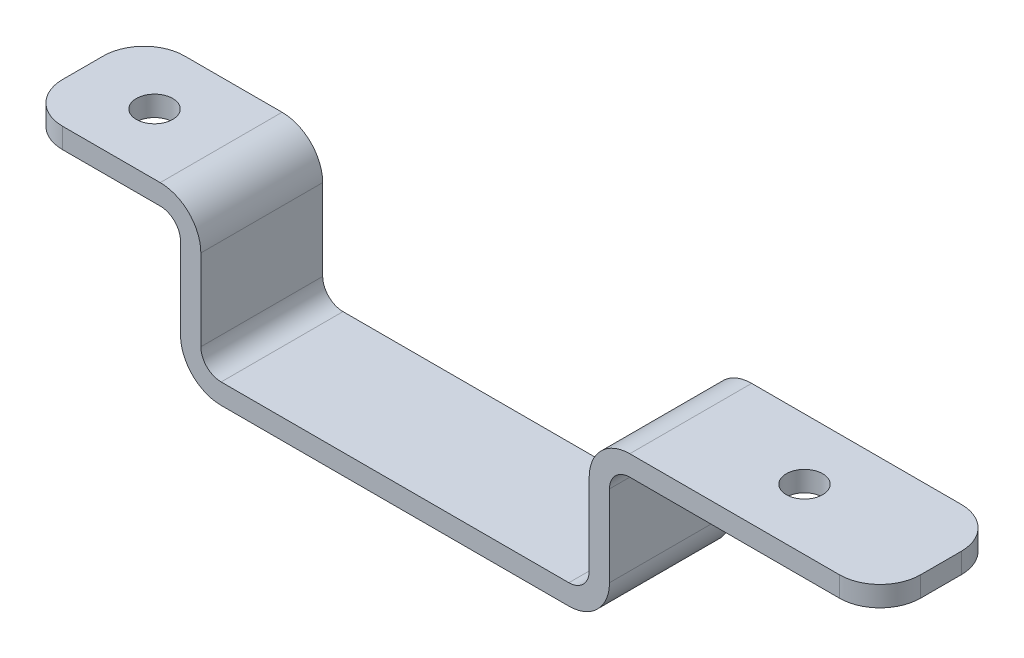
ISO-10303-21;
HEADER;
FILE_DESCRIPTION(('STEP AP214'),'2;1');
FILE_NAME('part.step','',(''),(''),'','','');
FILE_SCHEMA(('AUTOMOTIVE_DESIGN { 1 0 10303 214 1 1 1 1 }'));
ENDSEC;
DATA;
#1=APPLICATION_CONTEXT('core data for automotive mechanical design processes');
#2=APPLICATION_PROTOCOL_DEFINITION('international standard','automotive_design',2000,#1);
#3=PRODUCT_CONTEXT('',#1,'mechanical');
#4=PRODUCT('Part','Part','',(#3));
#5=PRODUCT_RELATED_PRODUCT_CATEGORY('part','',(#4));
#6=PRODUCT_DEFINITION_FORMATION('','',#4);
#7=PRODUCT_DEFINITION_CONTEXT('part definition',#1,'design');
#8=PRODUCT_DEFINITION('design','',#6,#7);
#9=PRODUCT_DEFINITION_SHAPE('','',#8);
#10=(LENGTH_UNIT() NAMED_UNIT(*) SI_UNIT(.MILLI.,.METRE.));
#11=(NAMED_UNIT(*) PLANE_ANGLE_UNIT() SI_UNIT($,.RADIAN.));
#12=(NAMED_UNIT(*) SI_UNIT($,.STERADIAN.) SOLID_ANGLE_UNIT());
#13=UNCERTAINTY_MEASURE_WITH_UNIT(LENGTH_MEASURE(1.E-05),#10,'distance_accuracy_value','');
#14=(GEOMETRIC_REPRESENTATION_CONTEXT(3) GLOBAL_UNCERTAINTY_ASSIGNED_CONTEXT((#13)) GLOBAL_UNIT_ASSIGNED_CONTEXT((#10,
#11,#12)) REPRESENTATION_CONTEXT('',''));
#15=CARTESIAN_POINT('',(0.,0.,0.));
#16=DIRECTION('',(0.,0.,1.));
#17=DIRECTION('',(1.,0.,0.));
#18=AXIS2_PLACEMENT_3D('',#15,#16,#17);
#19=CARTESIAN_POINT('',(-29.1465,11.1125,4.7625));
#20=DIRECTION('',(1.,0.,0.));
#21=DIRECTION('',(0.,0.,-1.));
#22=AXIS2_PLACEMENT_3D('',#19,#20,#21);
#23=PLANE('',#22);
#24=DIRECTION('',(0.,0.,-1.));
#25=VECTOR('',#24,1.);
#26=CARTESIAN_POINT('',(-29.1465,12.7,4.7625));
#27=LINE('',#26,#25);
#28=CARTESIAN_POINT('',(-29.1465,12.7,1.5875));
#29=VERTEX_POINT('',#28);
#30=CARTESIAN_POINT('',(-29.1465,12.7,-1.5875));
#31=VERTEX_POINT('',#30);
#32=EDGE_CURVE('E233',#29,#31,#27,.T.);
#33=ORIENTED_EDGE('',*,*,#32,.T.);
#34=DIRECTION('',(0.,-1.,0.));
#35=VECTOR('',#34,1.);
#36=CARTESIAN_POINT('',(-29.1465,11.1125,-1.5875));
#37=LINE('',#36,#35);
#38=CARTESIAN_POINT('',(-29.1465,11.1125,-1.5875));
#39=VERTEX_POINT('',#38);
#40=EDGE_CURVE('E337',#31,#39,#37,.T.);
#41=ORIENTED_EDGE('',*,*,#40,.T.);
#42=DIRECTION('',(0.,0.,-1.));
#43=VECTOR('',#42,1.);
#44=CARTESIAN_POINT('',(-29.1465,11.1125,4.7625));
#45=LINE('',#44,#43);
#46=CARTESIAN_POINT('',(-29.1465,11.1125,1.5875));
#47=VERTEX_POINT('',#46);
#48=EDGE_CURVE('E242',#47,#39,#45,.T.);
#49=ORIENTED_EDGE('',*,*,#48,.F.);
#50=DIRECTION('',(0.,-1.,0.));
#51=VECTOR('',#50,1.);
#52=CARTESIAN_POINT('',(-29.1465,11.1125,1.5875));
#53=LINE('',#52,#51);
#54=EDGE_CURVE('E52',#47,#29,#53,.F.);
#55=ORIENTED_EDGE('',*,*,#54,.T.);
#56=EDGE_LOOP('',(#33,#41,#49,#55));
#57=FACE_BOUND('',#56,.T.);
#58=ADVANCED_FACE('F32',(#57),#23,.F.);
#59=CARTESIAN_POINT('',(-29.1465,11.1125,4.7625));
#60=DIRECTION('',(0.,1.,0.));
#61=DIRECTION('',(0.,0.,1.));
#62=AXIS2_PLACEMENT_3D('',#59,#60,#61);
#63=PLANE('',#62);
#64=CARTESIAN_POINT('',(-23.5585,11.1125,0.));
#65=DIRECTION('',(0.,-1.,0.));
#66=DIRECTION('',(0.,0.,-1.));
#67=AXIS2_PLACEMENT_3D('',#64,#65,#66);
#68=CIRCLE('',#67,1.42240000000001);
#69=CARTESIAN_POINT('',(-23.5585,11.1125,-1.42240000000001));
#70=VERTEX_POINT('',#69);
#71=EDGE_CURVE('E485',#70,#70,#68,.T.);
#72=ORIENTED_EDGE('',*,*,#71,.F.);
#73=EDGE_LOOP('',(#72));
#74=FACE_BOUND('',#73,.T.);
#75=ORIENTED_EDGE('',*,*,#48,.T.);
#76=CARTESIAN_POINT('',(-25.9715,11.1125,-1.5875));
#77=DIRECTION('',(0.,1.,0.));
#78=DIRECTION('',(0.,0.,1.));
#79=AXIS2_PLACEMENT_3D('',#76,#77,#78);
#80=CIRCLE('',#79,3.175);
#81=CARTESIAN_POINT('',(-25.9715,11.1125,-4.7625));
#82=VERTEX_POINT('',#81);
#83=EDGE_CURVE('E342',#39,#82,#80,.F.);
#84=ORIENTED_EDGE('',*,*,#83,.T.);
#85=DIRECTION('',(1.,0.,0.));
#86=VECTOR('',#85,1.);
#87=CARTESIAN_POINT('',(-29.1465,11.1125,-4.7625));
#88=LINE('',#87,#86);
#89=CARTESIAN_POINT('',(-18.3515,11.1125,-4.7625));
#90=VERTEX_POINT('',#89);
#91=EDGE_CURVE('E365',#82,#90,#88,.T.);
#92=ORIENTED_EDGE('',*,*,#91,.T.);
#93=DIRECTION('',(0.,0.,-1.));
#94=VECTOR('',#93,1.);
#95=CARTESIAN_POINT('',(-18.3515,11.1125,4.7625));
#96=LINE('',#95,#94);
#97=CARTESIAN_POINT('',(-18.3515,11.1125,4.7625));
#98=VERTEX_POINT('',#97);
#99=EDGE_CURVE('E253',#90,#98,#96,.F.);
#100=ORIENTED_EDGE('',*,*,#99,.T.);
#101=DIRECTION('',(1.,0.,0.));
#102=VECTOR('',#101,1.);
#103=CARTESIAN_POINT('',(-29.1465,11.1125,4.7625));
#104=LINE('',#103,#102);
#105=CARTESIAN_POINT('',(-25.9715,11.1125,4.7625));
#106=VERTEX_POINT('',#105);
#107=EDGE_CURVE('E232',#106,#98,#104,.T.);
#108=ORIENTED_EDGE('',*,*,#107,.F.);
#109=CARTESIAN_POINT('',(-25.9715,11.1125,1.5875));
#110=DIRECTION('',(0.,1.,0.));
#111=DIRECTION('',(0.,0.,1.));
#112=AXIS2_PLACEMENT_3D('',#109,#110,#111);
#113=CIRCLE('',#112,3.175);
#114=EDGE_CURVE('E340',#106,#47,#113,.F.);
#115=ORIENTED_EDGE('',*,*,#114,.T.);
#116=EDGE_LOOP('',(#75,#84,#92,#100,#108,#115));
#117=FACE_BOUND('',#116,.T.);
#118=ADVANCED_FACE('F359',(#74,#117),#63,.F.);
#119=CARTESIAN_POINT('',(-16.764,11.1125,4.7625));
#120=DIRECTION('',(1.,0.,0.));
#121=DIRECTION('',(0.,1.,0.));
#122=AXIS2_PLACEMENT_3D('',#119,#120,#121);
#123=PLANE('',#122);
#124=DIRECTION('',(0.,-1.,0.));
#125=VECTOR('',#124,1.);
#126=CARTESIAN_POINT('',(-16.764,11.1125,-4.7625));
#127=LINE('',#126,#125);
#128=CARTESIAN_POINT('',(-16.764,9.525,-4.7625));
#129=VERTEX_POINT('',#128);
#130=CARTESIAN_POINT('',(-16.764,3.175,-4.7625));
#131=VERTEX_POINT('',#130);
#132=EDGE_CURVE('E369',#129,#131,#127,.T.);
#133=ORIENTED_EDGE('',*,*,#132,.T.);
#134=DIRECTION('',(0.,0.,-1.));
#135=VECTOR('',#134,1.);
#136=CARTESIAN_POINT('',(-16.764,3.175,4.7625));
#137=LINE('',#136,#135);
#138=CARTESIAN_POINT('',(-16.764,3.175,4.7625));
#139=VERTEX_POINT('',#138);
#140=EDGE_CURVE('E289',#131,#139,#137,.F.);
#141=ORIENTED_EDGE('',*,*,#140,.T.);
#142=DIRECTION('',(0.,-1.,0.));
#143=VECTOR('',#142,1.);
#144=CARTESIAN_POINT('',(-16.764,11.1125,4.7625));
#145=LINE('',#144,#143);
#146=CARTESIAN_POINT('',(-16.764,9.525,4.7625));
#147=VERTEX_POINT('',#146);
#148=EDGE_CURVE('E492',#147,#139,#145,.T.);
#149=ORIENTED_EDGE('',*,*,#148,.F.);
#150=DIRECTION('',(0.,0.,-1.));
#151=VECTOR('',#150,1.);
#152=CARTESIAN_POINT('',(-16.764,9.525,-4.7625));
#153=LINE('',#152,#151);
#154=EDGE_CURVE('E250',#147,#129,#153,.T.);
#155=ORIENTED_EDGE('',*,*,#154,.T.);
#156=EDGE_LOOP('',(#133,#141,#149,#155));
#157=FACE_BOUND('',#156,.T.);
#158=ADVANCED_FACE('F431',(#157),#123,.F.);
#159=CARTESIAN_POINT('',(-16.764,0.,4.7625));
#160=DIRECTION('',(0.,1.,0.));
#161=DIRECTION('',(-1.,0.,0.));
#162=AXIS2_PLACEMENT_3D('',#159,#160,#161);
#163=PLANE('',#162);
#164=DIRECTION('',(1.,0.,0.));
#165=VECTOR('',#164,1.);
#166=CARTESIAN_POINT('',(-16.764,0.,4.7625));
#167=LINE('',#166,#165);
#168=CARTESIAN_POINT('',(-13.589,0.,4.7625));
#169=VERTEX_POINT('',#168);
#170=CARTESIAN_POINT('',(13.589,0.,4.7625));
#171=VERTEX_POINT('',#170);
#172=EDGE_CURVE('E495',#169,#171,#167,.T.);
#173=ORIENTED_EDGE('',*,*,#172,.F.);
#174=DIRECTION('',(0.,0.,-1.));
#175=VECTOR('',#174,1.);
#176=CARTESIAN_POINT('',(-13.589,0.,4.7625));
#177=LINE('',#176,#175);
#178=CARTESIAN_POINT('',(-13.589,0.,-4.7625));
#179=VERTEX_POINT('',#178);
#180=EDGE_CURVE('E277',#169,#179,#177,.T.);
#181=ORIENTED_EDGE('',*,*,#180,.T.);
#182=DIRECTION('',(1.,0.,0.));
#183=VECTOR('',#182,1.);
#184=CARTESIAN_POINT('',(-16.764,0.,-4.7625));
#185=LINE('',#184,#183);
#186=CARTESIAN_POINT('',(13.589,0.,-4.7625));
#187=VERTEX_POINT('',#186);
#188=EDGE_CURVE('E373',#179,#187,#185,.T.);
#189=ORIENTED_EDGE('',*,*,#188,.T.);
#190=DIRECTION('',(0.,0.,-1.));
#191=VECTOR('',#190,1.);
#192=CARTESIAN_POINT('',(13.589,0.,4.7625));
#193=LINE('',#192,#191);
#194=EDGE_CURVE('E275',#187,#171,#193,.F.);
#195=ORIENTED_EDGE('',*,*,#194,.T.);
#196=EDGE_LOOP('',(#173,#181,#189,#195));
#197=FACE_BOUND('',#196,.T.);
#198=ADVANCED_FACE('F437',(#197),#163,.F.);
#199=CARTESIAN_POINT('',(16.764,0.,4.7625));
#200=DIRECTION('',(-1.,0.,0.));
#201=DIRECTION('',(0.,-1.,0.));
#202=AXIS2_PLACEMENT_3D('',#199,#200,#201);
#203=PLANE('',#202);
#204=DIRECTION('',(0.,1.,0.));
#205=VECTOR('',#204,1.);
#206=CARTESIAN_POINT('',(16.764,0.,4.7625));
#207=LINE('',#206,#205);
#208=CARTESIAN_POINT('',(16.764,3.17500000000001,4.7625));
#209=VERTEX_POINT('',#208);
#210=CARTESIAN_POINT('',(16.764,9.52500000000001,4.7625));
#211=VERTEX_POINT('',#210);
#212=EDGE_CURVE('E498',#209,#211,#207,.T.);
#213=ORIENTED_EDGE('',*,*,#212,.F.);
#214=DIRECTION('',(0.,0.,-1.));
#215=VECTOR('',#214,1.);
#216=CARTESIAN_POINT('',(16.764,3.17500000000001,4.7625));
#217=LINE('',#216,#215);
#218=CARTESIAN_POINT('',(16.764,3.17500000000001,-4.7625));
#219=VERTEX_POINT('',#218);
#220=EDGE_CURVE('E299',#209,#219,#217,.T.);
#221=ORIENTED_EDGE('',*,*,#220,.T.);
#222=DIRECTION('',(0.,1.,0.));
#223=VECTOR('',#222,1.);
#224=CARTESIAN_POINT('',(16.764,0.,-4.7625));
#225=LINE('',#224,#223);
#226=CARTESIAN_POINT('',(16.764,9.52500000000001,-4.7625));
#227=VERTEX_POINT('',#226);
#228=EDGE_CURVE('E382',#219,#227,#225,.T.);
#229=ORIENTED_EDGE('',*,*,#228,.T.);
#230=DIRECTION('',(0.,0.,-1.));
#231=VECTOR('',#230,1.);
#232=CARTESIAN_POINT('',(16.764,9.52500000000001,4.7625));
#233=LINE('',#232,#231);
#234=EDGE_CURVE('E205',#227,#211,#233,.F.);
#235=ORIENTED_EDGE('',*,*,#234,.T.);
#236=EDGE_LOOP('',(#213,#221,#229,#235));
#237=FACE_BOUND('',#236,.T.);
#238=ADVANCED_FACE('F441',(#237),#203,.F.);
#239=CARTESIAN_POINT('',(16.764,11.1125,4.7625));
#240=DIRECTION('',(0.,1.,0.));
#241=DIRECTION('',(-1.,0.,0.));
#242=AXIS2_PLACEMENT_3D('',#239,#240,#241);
#243=PLANE('',#242);
#244=CARTESIAN_POINT('',(27.2415,11.1125,0.));
#245=DIRECTION('',(0.,-1.,0.));
#246=DIRECTION('',(0.,0.,-1.));
#247=AXIS2_PLACEMENT_3D('',#244,#245,#246);
#248=CIRCLE('',#247,1.42240000000001);
#249=CARTESIAN_POINT('',(27.2415,11.1125,-1.42240000000002));
#250=VERTEX_POINT('',#249);
#251=EDGE_CURVE('E376',#250,#250,#248,.T.);
#252=ORIENTED_EDGE('',*,*,#251,.F.);
#253=EDGE_LOOP('',(#252));
#254=FACE_BOUND('',#253,.T.);
#255=DIRECTION('',(1.,0.,0.));
#256=VECTOR('',#255,1.);
#257=CARTESIAN_POINT('',(16.764,11.1125,-4.7625));
#258=LINE('',#257,#256);
#259=CARTESIAN_POINT('',(18.3515,11.1125,-4.7625));
#260=VERTEX_POINT('',#259);
#261=CARTESIAN_POINT('',(34.7345,11.1125,-4.7625));
#262=VERTEX_POINT('',#261);
#263=EDGE_CURVE('E384',#260,#262,#258,.T.);
#264=ORIENTED_EDGE('',*,*,#263,.T.);
#265=CARTESIAN_POINT('',(34.7345,11.1125,-1.5875));
#266=DIRECTION('',(0.,1.,0.));
#267=DIRECTION('',(-1.,0.,0.));
#268=AXIS2_PLACEMENT_3D('',#265,#266,#267);
#269=CIRCLE('',#268,3.175);
#270=CARTESIAN_POINT('',(37.9095,11.1125,-1.5875));
#271=VERTEX_POINT('',#270);
#272=EDGE_CURVE('E328',#262,#271,#269,.F.);
#273=ORIENTED_EDGE('',*,*,#272,.T.);
#274=DIRECTION('',(0.,0.,-1.));
#275=VECTOR('',#274,1.);
#276=CARTESIAN_POINT('',(37.9095,11.1125,4.7625));
#277=LINE('',#276,#275);
#278=CARTESIAN_POINT('',(37.9095,11.1125,1.5875));
#279=VERTEX_POINT('',#278);
#280=EDGE_CURVE('E239',#279,#271,#277,.T.);
#281=ORIENTED_EDGE('',*,*,#280,.F.);
#282=CARTESIAN_POINT('',(34.7345,11.1125,1.5875));
#283=DIRECTION('',(0.,1.,0.));
#284=DIRECTION('',(-1.,0.,0.));
#285=AXIS2_PLACEMENT_3D('',#282,#283,#284);
#286=CIRCLE('',#285,3.175);
#287=CARTESIAN_POINT('',(34.7345,11.1125,4.7625));
#288=VERTEX_POINT('',#287);
#289=EDGE_CURVE('E326',#279,#288,#286,.F.);
#290=ORIENTED_EDGE('',*,*,#289,.T.);
#291=DIRECTION('',(1.,0.,0.));
#292=VECTOR('',#291,1.);
#293=CARTESIAN_POINT('',(16.764,11.1125,4.7625));
#294=LINE('',#293,#292);
#295=CARTESIAN_POINT('',(18.3515,11.1125,4.7625));
#296=VERTEX_POINT('',#295);
#297=EDGE_CURVE('E402',#296,#288,#294,.T.);
#298=ORIENTED_EDGE('',*,*,#297,.F.);
#299=DIRECTION('',(0.,0.,-1.));
#300=VECTOR('',#299,1.);
#301=CARTESIAN_POINT('',(18.3515,11.1125,-4.7625));
#302=LINE('',#301,#300);
#303=EDGE_CURVE('E256',#296,#260,#302,.T.);
#304=ORIENTED_EDGE('',*,*,#303,.T.);
#305=EDGE_LOOP('',(#264,#273,#281,#290,#298,#304));
#306=FACE_BOUND('',#305,.T.);
#307=ADVANCED_FACE('F445',(#254,#306),#243,.F.);
#308=CARTESIAN_POINT('',(37.9095,12.7,4.7625));
#309=DIRECTION('',(-1.,0.,0.));
#310=DIRECTION('',(0.,-1.,0.));
#311=AXIS2_PLACEMENT_3D('',#308,#309,#310);
#312=PLANE('',#311);
#313=ORIENTED_EDGE('',*,*,#280,.T.);
#314=DIRECTION('',(0.,1.,0.));
#315=VECTOR('',#314,1.);
#316=CARTESIAN_POINT('',(37.9095,12.7,-1.5875));
#317=LINE('',#316,#315);
#318=CARTESIAN_POINT('',(37.9095,12.7,-1.5875));
#319=VERTEX_POINT('',#318);
#320=EDGE_CURVE('E315',#271,#319,#317,.T.);
#321=ORIENTED_EDGE('',*,*,#320,.T.);
#322=DIRECTION('',(0.,0.,-1.));
#323=VECTOR('',#322,1.);
#324=CARTESIAN_POINT('',(37.9095,12.7,4.7625));
#325=LINE('',#324,#323);
#326=CARTESIAN_POINT('',(37.9095,12.7,1.5875));
#327=VERTEX_POINT('',#326);
#328=EDGE_CURVE('E235',#327,#319,#325,.T.);
#329=ORIENTED_EDGE('',*,*,#328,.F.);
#330=DIRECTION('',(0.,1.,0.));
#331=VECTOR('',#330,1.);
#332=CARTESIAN_POINT('',(37.9095,12.7,1.5875));
#333=LINE('',#332,#331);
#334=EDGE_CURVE('E313',#327,#279,#333,.F.);
#335=ORIENTED_EDGE('',*,*,#334,.T.);
#336=EDGE_LOOP('',(#313,#321,#329,#335));
#337=FACE_BOUND('',#336,.T.);
#338=ADVANCED_FACE('F449',(#337),#312,.F.);
#339=CARTESIAN_POINT('',(15.1765,12.7,4.7625));
#340=DIRECTION('',(0.,-1.,0.));
#341=DIRECTION('',(0.,0.,-1.));
#342=AXIS2_PLACEMENT_3D('',#339,#340,#341);
#343=PLANE('',#342);
#344=CARTESIAN_POINT('',(27.2415,12.7,0.));
#345=DIRECTION('',(0.,-1.,0.));
#346=DIRECTION('',(0.,0.,-1.));
#347=AXIS2_PLACEMENT_3D('',#344,#345,#346);
#348=CIRCLE('',#347,1.42240000000001);
#349=CARTESIAN_POINT('',(27.2415,12.7,-1.42240000000002));
#350=VERTEX_POINT('',#349);
#351=EDGE_CURVE('E370',#350,#350,#348,.T.);
#352=ORIENTED_EDGE('',*,*,#351,.T.);
#353=EDGE_LOOP('',(#352));
#354=FACE_BOUND('',#353,.T.);
#355=ORIENTED_EDGE('',*,*,#328,.T.);
#356=CARTESIAN_POINT('',(34.7345,12.7,-1.5875));
#357=DIRECTION('',(0.,-1.,0.));
#358=DIRECTION('',(0.,0.,-1.));
#359=AXIS2_PLACEMENT_3D('',#356,#357,#358);
#360=CIRCLE('',#359,3.175);
#361=CARTESIAN_POINT('',(34.7345,12.7,-4.7625));
#362=VERTEX_POINT('',#361);
#363=EDGE_CURVE('E320',#319,#362,#360,.F.);
#364=ORIENTED_EDGE('',*,*,#363,.T.);
#365=DIRECTION('',(-1.,0.,0.));
#366=VECTOR('',#365,1.);
#367=CARTESIAN_POINT('',(15.1765,12.7,-4.7625));
#368=LINE('',#367,#366);
#369=CARTESIAN_POINT('',(18.3515,12.7,-4.7625));
#370=VERTEX_POINT('',#369);
#371=EDGE_CURVE('E227',#362,#370,#368,.T.);
#372=ORIENTED_EDGE('',*,*,#371,.T.);
#373=DIRECTION('',(0.,0.,-1.));
#374=VECTOR('',#373,1.);
#375=CARTESIAN_POINT('',(18.3515,12.7,4.7625));
#376=LINE('',#375,#374);
#377=CARTESIAN_POINT('',(18.3515,12.7,4.7625));
#378=VERTEX_POINT('',#377);
#379=EDGE_CURVE('E305',#370,#378,#376,.F.);
#380=ORIENTED_EDGE('',*,*,#379,.T.);
#381=DIRECTION('',(-1.,0.,0.));
#382=VECTOR('',#381,1.);
#383=CARTESIAN_POINT('',(15.1765,12.7,4.7625));
#384=LINE('',#383,#382);
#385=CARTESIAN_POINT('',(34.7345,12.7,4.7625));
#386=VERTEX_POINT('',#385);
#387=EDGE_CURVE('E397',#386,#378,#384,.T.);
#388=ORIENTED_EDGE('',*,*,#387,.F.);
#389=CARTESIAN_POINT('',(34.7345,12.7,1.5875));
#390=DIRECTION('',(0.,-1.,0.));
#391=DIRECTION('',(0.,0.,-1.));
#392=AXIS2_PLACEMENT_3D('',#389,#390,#391);
#393=CIRCLE('',#392,3.175);
#394=EDGE_CURVE('E318',#386,#327,#393,.F.);
#395=ORIENTED_EDGE('',*,*,#394,.T.);
#396=EDGE_LOOP('',(#355,#364,#372,#380,#388,#395));
#397=FACE_BOUND('',#396,.T.);
#398=ADVANCED_FACE('F387',(#354,#397),#343,.F.);
#399=CARTESIAN_POINT('',(15.1765,1.5875,4.7625));
#400=DIRECTION('',(1.,0.,0.));
#401=DIRECTION('',(0.,0.,-1.));
#402=AXIS2_PLACEMENT_3D('',#399,#400,#401);
#403=PLANE('',#402);
#404=DIRECTION('',(0.,-1.,0.));
#405=VECTOR('',#404,1.);
#406=CARTESIAN_POINT('',(15.1765,1.5875,4.7625));
#407=LINE('',#406,#405);
#408=CARTESIAN_POINT('',(15.1765,9.525,4.7625));
#409=VERTEX_POINT('',#408);
#410=CARTESIAN_POINT('',(15.1765,3.175,4.7625));
#411=VERTEX_POINT('',#410);
#412=EDGE_CURVE('E396',#409,#411,#407,.T.);
#413=ORIENTED_EDGE('',*,*,#412,.F.);
#414=DIRECTION('',(0.,0.,-1.));
#415=VECTOR('',#414,1.);
#416=CARTESIAN_POINT('',(15.1765,9.525,4.7625));
#417=LINE('',#416,#415);
#418=CARTESIAN_POINT('',(15.1765,9.525,-4.7625));
#419=VERTEX_POINT('',#418);
#420=EDGE_CURVE('E302',#409,#419,#417,.T.);
#421=ORIENTED_EDGE('',*,*,#420,.T.);
#422=DIRECTION('',(0.,-1.,0.));
#423=VECTOR('',#422,1.);
#424=CARTESIAN_POINT('',(15.1765,1.5875,-4.7625));
#425=LINE('',#424,#423);
#426=CARTESIAN_POINT('',(15.1765,3.175,-4.7625));
#427=VERTEX_POINT('',#426);
#428=EDGE_CURVE('E222',#419,#427,#425,.T.);
#429=ORIENTED_EDGE('',*,*,#428,.T.);
#430=DIRECTION('',(0.,0.,-1.));
#431=VECTOR('',#430,1.);
#432=CARTESIAN_POINT('',(15.1765,3.175,4.7625));
#433=LINE('',#432,#431);
#434=EDGE_CURVE('E200',#427,#411,#433,.F.);
#435=ORIENTED_EDGE('',*,*,#434,.T.);
#436=EDGE_LOOP('',(#413,#421,#429,#435));
#437=FACE_BOUND('',#436,.T.);
#438=ADVANCED_FACE('F399',(#437),#403,.F.);
#439=CARTESIAN_POINT('',(-15.1765,1.5875,4.7625));
#440=DIRECTION('',(0.,-1.,0.));
#441=DIRECTION('',(1.,0.,0.));
#442=AXIS2_PLACEMENT_3D('',#439,#440,#441);
#443=PLANE('',#442);
#444=DIRECTION('',(-1.,0.,0.));
#445=VECTOR('',#444,1.);
#446=CARTESIAN_POINT('',(-15.1765,1.5875,4.7625));
#447=LINE('',#446,#445);
#448=CARTESIAN_POINT('',(13.589,1.5875,4.7625));
#449=VERTEX_POINT('',#448);
#450=CARTESIAN_POINT('',(-13.589,1.5875,4.7625));
#451=VERTEX_POINT('',#450);
#452=EDGE_CURVE('E214',#449,#451,#447,.T.);
#453=ORIENTED_EDGE('',*,*,#452,.F.);
#454=DIRECTION('',(0.,0.,-1.));
#455=VECTOR('',#454,1.);
#456=CARTESIAN_POINT('',(13.589,1.5875,-4.7625));
#457=LINE('',#456,#455);
#458=CARTESIAN_POINT('',(13.589,1.5875,-4.7625));
#459=VERTEX_POINT('',#458);
#460=EDGE_CURVE('E198',#449,#459,#457,.T.);
#461=ORIENTED_EDGE('',*,*,#460,.T.);
#462=DIRECTION('',(-1.,0.,0.));
#463=VECTOR('',#462,1.);
#464=CARTESIAN_POINT('',(-15.1765,1.5875,-4.7625));
#465=LINE('',#464,#463);
#466=CARTESIAN_POINT('',(-13.589,1.5875,-4.7625));
#467=VERTEX_POINT('',#466);
#468=EDGE_CURVE('E211',#459,#467,#465,.T.);
#469=ORIENTED_EDGE('',*,*,#468,.T.);
#470=DIRECTION('',(0.,0.,-1.));
#471=VECTOR('',#470,1.);
#472=CARTESIAN_POINT('',(-13.589,1.5875,4.7625));
#473=LINE('',#472,#471);
#474=EDGE_CURVE('E215',#467,#451,#473,.F.);
#475=ORIENTED_EDGE('',*,*,#474,.T.);
#476=EDGE_LOOP('',(#453,#461,#469,#475));
#477=FACE_BOUND('',#476,.T.);
#478=ADVANCED_FACE('F210',(#477),#443,.F.);
#479=CARTESIAN_POINT('',(-15.1765,12.7,4.7625));
#480=DIRECTION('',(-1.,0.,0.));
#481=DIRECTION('',(0.,-1.,0.));
#482=AXIS2_PLACEMENT_3D('',#479,#480,#481);
#483=PLANE('',#482);
#484=DIRECTION('',(0.,1.,0.));
#485=VECTOR('',#484,1.);
#486=CARTESIAN_POINT('',(-15.1765,12.7,-4.7625));
#487=LINE('',#486,#485);
#488=CARTESIAN_POINT('',(-15.1765,3.175,-4.7625));
#489=VERTEX_POINT('',#488);
#490=CARTESIAN_POINT('',(-15.1765,9.525,-4.7625));
#491=VERTEX_POINT('',#490);
#492=EDGE_CURVE('E221',#489,#491,#487,.T.);
#493=ORIENTED_EDGE('',*,*,#492,.T.);
#494=DIRECTION('',(0.,0.,-1.));
#495=VECTOR('',#494,1.);
#496=CARTESIAN_POINT('',(-15.1765,9.525,4.7625));
#497=LINE('',#496,#495);
#498=CARTESIAN_POINT('',(-15.1765,9.525,4.7625));
#499=VERTEX_POINT('',#498);
#500=EDGE_CURVE('E311',#491,#499,#497,.F.);
#501=ORIENTED_EDGE('',*,*,#500,.T.);
#502=DIRECTION('',(0.,1.,0.));
#503=VECTOR('',#502,1.);
#504=CARTESIAN_POINT('',(-15.1765,12.7,4.7625));
#505=LINE('',#504,#503);
#506=CARTESIAN_POINT('',(-15.1765,3.175,4.7625));
#507=VERTEX_POINT('',#506);
#508=EDGE_CURVE('E356',#507,#499,#505,.T.);
#509=ORIENTED_EDGE('',*,*,#508,.F.);
#510=DIRECTION('',(0.,0.,-1.));
#511=VECTOR('',#510,1.);
#512=CARTESIAN_POINT('',(-15.1765,3.175,-4.7625));
#513=LINE('',#512,#511);
#514=EDGE_CURVE('E247',#507,#489,#513,.T.);
#515=ORIENTED_EDGE('',*,*,#514,.T.);
#516=EDGE_LOOP('',(#493,#501,#509,#515));
#517=FACE_BOUND('',#516,.T.);
#518=ADVANCED_FACE('F412',(#517),#483,.F.);
#519=CARTESIAN_POINT('',(-29.1465,12.7,4.7625));
#520=DIRECTION('',(0.,-1.,0.));
#521=DIRECTION('',(0.,0.,-1.));
#522=AXIS2_PLACEMENT_3D('',#519,#520,#521);
#523=PLANE('',#522);
#524=CARTESIAN_POINT('',(-23.5585,12.7,0.));
#525=DIRECTION('',(0.,-1.,0.));
#526=DIRECTION('',(0.,0.,-1.));
#527=AXIS2_PLACEMENT_3D('',#524,#525,#526);
#528=CIRCLE('',#527,1.42240000000001);
#529=CARTESIAN_POINT('',(-23.5585,12.7,-1.42240000000001));
#530=VERTEX_POINT('',#529);
#531=EDGE_CURVE('E482',#530,#530,#528,.T.);
#532=ORIENTED_EDGE('',*,*,#531,.T.);
#533=EDGE_LOOP('',(#532));
#534=FACE_BOUND('',#533,.T.);
#535=DIRECTION('',(-1.,0.,0.));
#536=VECTOR('',#535,1.);
#537=CARTESIAN_POINT('',(-29.1465,12.7,-4.7625));
#538=LINE('',#537,#536);
#539=CARTESIAN_POINT('',(-18.3515,12.7,-4.7625));
#540=VERTEX_POINT('',#539);
#541=CARTESIAN_POINT('',(-25.9715,12.7,-4.7625));
#542=VERTEX_POINT('',#541);
#543=EDGE_CURVE('E225',#540,#542,#538,.T.);
#544=ORIENTED_EDGE('',*,*,#543,.T.);
#545=CARTESIAN_POINT('',(-25.9715,12.7,-1.5875));
#546=DIRECTION('',(0.,-1.,0.));
#547=DIRECTION('',(0.,0.,-1.));
#548=AXIS2_PLACEMENT_3D('',#545,#546,#547);
#549=CIRCLE('',#548,3.175);
#550=EDGE_CURVE('E11',#542,#31,#549,.F.);
#551=ORIENTED_EDGE('',*,*,#550,.T.);
#552=ORIENTED_EDGE('',*,*,#32,.F.);
#553=CARTESIAN_POINT('',(-25.9715,12.7,1.5875));
#554=DIRECTION('',(0.,-1.,0.));
#555=DIRECTION('',(0.,0.,-1.));
#556=AXIS2_PLACEMENT_3D('',#553,#554,#555);
#557=CIRCLE('',#556,3.175);
#558=CARTESIAN_POINT('',(-25.9715,12.7,4.7625));
#559=VERTEX_POINT('',#558);
#560=EDGE_CURVE('E40',#29,#559,#557,.F.);
#561=ORIENTED_EDGE('',*,*,#560,.T.);
#562=DIRECTION('',(-1.,0.,0.));
#563=VECTOR('',#562,1.);
#564=CARTESIAN_POINT('',(-29.1465,12.7,4.7625));
#565=LINE('',#564,#563);
#566=CARTESIAN_POINT('',(-18.3515,12.7,4.7625));
#567=VERTEX_POINT('',#566);
#568=EDGE_CURVE('E236',#567,#559,#565,.T.);
#569=ORIENTED_EDGE('',*,*,#568,.F.);
#570=DIRECTION('',(0.,0.,-1.));
#571=VECTOR('',#570,1.);
#572=CARTESIAN_POINT('',(-18.3515,12.7,4.7625));
#573=LINE('',#572,#571);
#574=EDGE_CURVE('E308',#567,#540,#573,.T.);
#575=ORIENTED_EDGE('',*,*,#574,.T.);
#576=EDGE_LOOP('',(#544,#551,#552,#561,#569,#575));
#577=FACE_BOUND('',#576,.T.);
#578=ADVANCED_FACE('F346',(#534,#577),#523,.F.);
#579=CARTESIAN_POINT('',(-29.1465,12.7,4.7625));
#580=DIRECTION('',(0.,0.,-1.));
#581=DIRECTION('',(-1.,0.,0.));
#582=AXIS2_PLACEMENT_3D('',#579,#580,#581);
#583=PLANE('',#582);
#584=ORIENTED_EDGE('',*,*,#297,.T.);
#585=DIRECTION('',(0.,1.,0.));
#586=VECTOR('',#585,1.);
#587=CARTESIAN_POINT('',(34.7345,12.6999999999997,4.7625));
#588=LINE('',#587,#586);
#589=EDGE_CURVE('E333',#288,#386,#588,.T.);
#590=ORIENTED_EDGE('',*,*,#589,.T.);
#591=ORIENTED_EDGE('',*,*,#387,.T.);
#592=CARTESIAN_POINT('',(18.3515,9.525,4.7625));
#593=DIRECTION('',(0.,0.,-1.));
#594=DIRECTION('',(-1.,0.,0.));
#595=AXIS2_PLACEMENT_3D('',#592,#593,#594);
#596=CIRCLE('',#595,3.175);
#597=EDGE_CURVE('E293',#378,#409,#596,.F.);
#598=ORIENTED_EDGE('',*,*,#597,.T.);
#599=ORIENTED_EDGE('',*,*,#412,.T.);
#600=CARTESIAN_POINT('',(13.589,3.175,4.7625));
#601=DIRECTION('',(0.,0.,-1.));
#602=DIRECTION('',(-1.,0.,0.));
#603=AXIS2_PLACEMENT_3D('',#600,#601,#602);
#604=CIRCLE('',#603,1.5875);
#605=EDGE_CURVE('E204',#411,#449,#604,.T.);
#606=ORIENTED_EDGE('',*,*,#605,.T.);
#607=ORIENTED_EDGE('',*,*,#452,.T.);
#608=CARTESIAN_POINT('',(-13.589,3.175,4.7625));
#609=DIRECTION('',(0.,0.,-1.));
#610=DIRECTION('',(-1.,0.,0.));
#611=AXIS2_PLACEMENT_3D('',#608,#609,#610);
#612=CIRCLE('',#611,1.5875);
#613=EDGE_CURVE('E263',#451,#507,#612,.T.);
#614=ORIENTED_EDGE('',*,*,#613,.T.);
#615=ORIENTED_EDGE('',*,*,#508,.T.);
#616=CARTESIAN_POINT('',(-18.3515,9.525,4.7625));
#617=DIRECTION('',(0.,0.,-1.));
#618=DIRECTION('',(-1.,0.,0.));
#619=AXIS2_PLACEMENT_3D('',#616,#617,#618);
#620=CIRCLE('',#619,3.175);
#621=EDGE_CURVE('E291',#499,#567,#620,.F.);
#622=ORIENTED_EDGE('',*,*,#621,.T.);
#623=ORIENTED_EDGE('',*,*,#568,.T.);
#624=DIRECTION('',(0.,-1.,0.));
#625=VECTOR('',#624,1.);
#626=CARTESIAN_POINT('',(-25.9715,12.7,4.7625));
#627=LINE('',#626,#625);
#628=EDGE_CURVE('E330',#559,#106,#627,.T.);
#629=ORIENTED_EDGE('',*,*,#628,.T.);
#630=ORIENTED_EDGE('',*,*,#107,.T.);
#631=CARTESIAN_POINT('',(-18.3515,9.525,4.7625));
#632=DIRECTION('',(0.,0.,-1.));
#633=DIRECTION('',(-1.,0.,0.));
#634=AXIS2_PLACEMENT_3D('',#631,#632,#633);
#635=CIRCLE('',#634,1.5875);
#636=EDGE_CURVE('E268',#98,#147,#635,.T.);
#637=ORIENTED_EDGE('',*,*,#636,.T.);
#638=ORIENTED_EDGE('',*,*,#148,.T.);
#639=CARTESIAN_POINT('',(-13.589,3.175,4.7625));
#640=DIRECTION('',(0.,0.,-1.));
#641=DIRECTION('',(-1.,0.,0.));
#642=AXIS2_PLACEMENT_3D('',#639,#640,#641);
#643=CIRCLE('',#642,3.175);
#644=EDGE_CURVE('E297',#139,#169,#643,.F.);
#645=ORIENTED_EDGE('',*,*,#644,.T.);
#646=ORIENTED_EDGE('',*,*,#172,.T.);
#647=CARTESIAN_POINT('',(13.589,3.17500000000001,4.7625));
#648=DIRECTION('',(0.,0.,-1.));
#649=DIRECTION('',(-1.,0.,0.));
#650=AXIS2_PLACEMENT_3D('',#647,#648,#649);
#651=CIRCLE('',#650,3.175);
#652=EDGE_CURVE('E295',#171,#209,#651,.F.);
#653=ORIENTED_EDGE('',*,*,#652,.T.);
#654=ORIENTED_EDGE('',*,*,#212,.T.);
#655=CARTESIAN_POINT('',(18.3515,9.52500000000001,4.7625));
#656=DIRECTION('',(0.,0.,-1.));
#657=DIRECTION('',(-1.,0.,0.));
#658=AXIS2_PLACEMENT_3D('',#655,#656,#657);
#659=CIRCLE('',#658,1.5875);
#660=EDGE_CURVE('E273',#211,#296,#659,.T.);
#661=ORIENTED_EDGE('',*,*,#660,.T.);
#662=EDGE_LOOP('',(#584,#590,#591,#598,#599,#606,#607,#614,#615,#622,#623,#629,#630,#637,#638,
#645,#646,#653,#654,#661));
#663=FACE_BOUND('',#662,.T.);
#664=ADVANCED_FACE('F352',(#663),#583,.F.);
#665=CARTESIAN_POINT('',(-29.1465,12.7,-4.7625));
#666=DIRECTION('',(0.,0.,-1.));
#667=DIRECTION('',(-1.,0.,0.));
#668=AXIS2_PLACEMENT_3D('',#665,#666,#667);
#669=PLANE('',#668);
#670=ORIENTED_EDGE('',*,*,#371,.F.);
#671=DIRECTION('',(0.,1.,0.));
#672=VECTOR('',#671,1.);
#673=CARTESIAN_POINT('',(34.7345,11.1125,-4.7625));
#674=LINE('',#673,#672);
#675=EDGE_CURVE('E324',#362,#262,#674,.F.);
#676=ORIENTED_EDGE('',*,*,#675,.T.);
#677=ORIENTED_EDGE('',*,*,#263,.F.);
#678=CARTESIAN_POINT('',(18.3515,9.52500000000001,-4.7625));
#679=DIRECTION('',(0.,0.,-1.));
#680=DIRECTION('',(-1.,0.,0.));
#681=AXIS2_PLACEMENT_3D('',#678,#679,#680);
#682=CIRCLE('',#681,1.5875);
#683=EDGE_CURVE('E270',#260,#227,#682,.F.);
#684=ORIENTED_EDGE('',*,*,#683,.T.);
#685=ORIENTED_EDGE('',*,*,#228,.F.);
#686=CARTESIAN_POINT('',(13.589,3.17500000000001,-4.7625));
#687=DIRECTION('',(0.,0.,-1.));
#688=DIRECTION('',(-1.,0.,0.));
#689=AXIS2_PLACEMENT_3D('',#686,#687,#688);
#690=CIRCLE('',#689,3.175);
#691=EDGE_CURVE('E285',#219,#187,#690,.T.);
#692=ORIENTED_EDGE('',*,*,#691,.T.);
#693=ORIENTED_EDGE('',*,*,#188,.F.);
#694=CARTESIAN_POINT('',(-13.589,3.175,-4.7625));
#695=DIRECTION('',(0.,0.,-1.));
#696=DIRECTION('',(-1.,0.,0.));
#697=AXIS2_PLACEMENT_3D('',#694,#695,#696);
#698=CIRCLE('',#697,3.175);
#699=EDGE_CURVE('E287',#179,#131,#698,.T.);
#700=ORIENTED_EDGE('',*,*,#699,.T.);
#701=ORIENTED_EDGE('',*,*,#132,.F.);
#702=CARTESIAN_POINT('',(-18.3515,9.525,-4.7625));
#703=DIRECTION('',(0.,0.,-1.));
#704=DIRECTION('',(-1.,0.,0.));
#705=AXIS2_PLACEMENT_3D('',#702,#703,#704);
#706=CIRCLE('',#705,1.5875);
#707=EDGE_CURVE('E265',#129,#90,#706,.F.);
#708=ORIENTED_EDGE('',*,*,#707,.T.);
#709=ORIENTED_EDGE('',*,*,#91,.F.);
#710=DIRECTION('',(0.,-1.,0.));
#711=VECTOR('',#710,1.);
#712=CARTESIAN_POINT('',(-25.9715,12.7,-4.7625));
#713=LINE('',#712,#711);
#714=EDGE_CURVE('E322',#82,#542,#713,.F.);
#715=ORIENTED_EDGE('',*,*,#714,.T.);
#716=ORIENTED_EDGE('',*,*,#543,.F.);
#717=CARTESIAN_POINT('',(-18.3515,9.525,-4.7625));
#718=DIRECTION('',(0.,0.,-1.));
#719=DIRECTION('',(-1.,0.,0.));
#720=AXIS2_PLACEMENT_3D('',#717,#718,#719);
#721=CIRCLE('',#720,3.175);
#722=EDGE_CURVE('E280',#540,#491,#721,.T.);
#723=ORIENTED_EDGE('',*,*,#722,.T.);
#724=ORIENTED_EDGE('',*,*,#492,.F.);
#725=CARTESIAN_POINT('',(-13.589,3.175,-4.7625));
#726=DIRECTION('',(0.,0.,-1.));
#727=DIRECTION('',(-1.,0.,0.));
#728=AXIS2_PLACEMENT_3D('',#725,#726,#727);
#729=CIRCLE('',#728,1.5875);
#730=EDGE_CURVE('E220',#489,#467,#729,.F.);
#731=ORIENTED_EDGE('',*,*,#730,.T.);
#732=ORIENTED_EDGE('',*,*,#468,.F.);
#733=CARTESIAN_POINT('',(13.589,3.175,-4.7625));
#734=DIRECTION('',(0.,0.,-1.));
#735=DIRECTION('',(-1.,0.,0.));
#736=AXIS2_PLACEMENT_3D('',#733,#734,#735);
#737=CIRCLE('',#736,1.5875);
#738=EDGE_CURVE('E194',#459,#427,#737,.F.);
#739=ORIENTED_EDGE('',*,*,#738,.T.);
#740=ORIENTED_EDGE('',*,*,#428,.F.);
#741=CARTESIAN_POINT('',(18.3515,9.525,-4.7625));
#742=DIRECTION('',(0.,0.,-1.));
#743=DIRECTION('',(-1.,0.,0.));
#744=AXIS2_PLACEMENT_3D('',#741,#742,#743);
#745=CIRCLE('',#744,3.175);
#746=EDGE_CURVE('E282',#419,#370,#745,.T.);
#747=ORIENTED_EDGE('',*,*,#746,.T.);
#748=EDGE_LOOP('',(#670,#676,#677,#684,#685,#692,#693,#700,#701,#708,#709,#715,#716,#723,#724,
#731,#732,#739,#740,#747));
#749=FACE_BOUND('',#748,.T.);
#750=ADVANCED_FACE('F218',(#749),#669,.T.);
#751=CARTESIAN_POINT('',(13.589,3.175,4.7625));
#752=DIRECTION('',(0.,0.,1.));
#753=DIRECTION('',(1.,0.,0.));
#754=AXIS2_PLACEMENT_3D('',#751,#752,#753);
#755=CYLINDRICAL_SURFACE('',#754,1.5875);
#756=ORIENTED_EDGE('',*,*,#605,.F.);
#757=ORIENTED_EDGE('',*,*,#434,.F.);
#758=ORIENTED_EDGE('',*,*,#738,.F.);
#759=ORIENTED_EDGE('',*,*,#460,.F.);
#760=EDGE_LOOP('',(#756,#757,#758,#759));
#761=FACE_BOUND('',#760,.T.);
#762=ADVANCED_FACE('F197',(#761),#755,.F.);
#763=CARTESIAN_POINT('',(-13.589,3.175,4.7625));
#764=DIRECTION('',(0.,0.,1.));
#765=DIRECTION('',(1.,0.,0.));
#766=AXIS2_PLACEMENT_3D('',#763,#764,#765);
#767=CYLINDRICAL_SURFACE('',#766,1.5875);
#768=ORIENTED_EDGE('',*,*,#613,.F.);
#769=ORIENTED_EDGE('',*,*,#474,.F.);
#770=ORIENTED_EDGE('',*,*,#730,.F.);
#771=ORIENTED_EDGE('',*,*,#514,.F.);
#772=EDGE_LOOP('',(#768,#769,#770,#771));
#773=FACE_BOUND('',#772,.T.);
#774=ADVANCED_FACE('F414',(#773),#767,.F.);
#775=CARTESIAN_POINT('',(-18.3515,9.525,4.7625));
#776=DIRECTION('',(0.,0.,1.));
#777=DIRECTION('',(1.,0.,0.));
#778=AXIS2_PLACEMENT_3D('',#775,#776,#777);
#779=CYLINDRICAL_SURFACE('',#778,1.5875);
#780=ORIENTED_EDGE('',*,*,#636,.F.);
#781=ORIENTED_EDGE('',*,*,#99,.F.);
#782=ORIENTED_EDGE('',*,*,#707,.F.);
#783=ORIENTED_EDGE('',*,*,#154,.F.);
#784=EDGE_LOOP('',(#780,#781,#782,#783));
#785=FACE_BOUND('',#784,.T.);
#786=ADVANCED_FACE('F416',(#785),#779,.F.);
#787=CARTESIAN_POINT('',(18.3515,9.52500000000001,4.7625));
#788=DIRECTION('',(0.,0.,1.));
#789=DIRECTION('',(1.,0.,0.));
#790=AXIS2_PLACEMENT_3D('',#787,#788,#789);
#791=CYLINDRICAL_SURFACE('',#790,1.5875);
#792=ORIENTED_EDGE('',*,*,#660,.F.);
#793=ORIENTED_EDGE('',*,*,#234,.F.);
#794=ORIENTED_EDGE('',*,*,#683,.F.);
#795=ORIENTED_EDGE('',*,*,#303,.F.);
#796=EDGE_LOOP('',(#792,#793,#794,#795));
#797=FACE_BOUND('',#796,.T.);
#798=ADVANCED_FACE('F422',(#797),#791,.F.);
#799=CARTESIAN_POINT('',(-13.589,3.175,4.7625));
#800=DIRECTION('',(0.,0.,-1.));
#801=DIRECTION('',(-1.,0.,0.));
#802=AXIS2_PLACEMENT_3D('',#799,#800,#801);
#803=CYLINDRICAL_SURFACE('',#802,3.175);
#804=ORIENTED_EDGE('',*,*,#644,.F.);
#805=ORIENTED_EDGE('',*,*,#140,.F.);
#806=ORIENTED_EDGE('',*,*,#699,.F.);
#807=ORIENTED_EDGE('',*,*,#180,.F.);
#808=EDGE_LOOP('',(#804,#805,#806,#807));
#809=FACE_BOUND('',#808,.T.);
#810=ADVANCED_FACE('F531',(#809),#803,.T.);
#811=CARTESIAN_POINT('',(13.589,3.17500000000001,4.7625));
#812=DIRECTION('',(0.,0.,-1.));
#813=DIRECTION('',(-1.,0.,0.));
#814=AXIS2_PLACEMENT_3D('',#811,#812,#813);
#815=CYLINDRICAL_SURFACE('',#814,3.175);
#816=ORIENTED_EDGE('',*,*,#652,.F.);
#817=ORIENTED_EDGE('',*,*,#194,.F.);
#818=ORIENTED_EDGE('',*,*,#691,.F.);
#819=ORIENTED_EDGE('',*,*,#220,.F.);
#820=EDGE_LOOP('',(#816,#817,#818,#819));
#821=FACE_BOUND('',#820,.T.);
#822=ADVANCED_FACE('F523',(#821),#815,.T.);
#823=CARTESIAN_POINT('',(18.3515,9.525,4.7625));
#824=DIRECTION('',(0.,0.,-1.));
#825=DIRECTION('',(-1.,0.,0.));
#826=AXIS2_PLACEMENT_3D('',#823,#824,#825);
#827=CYLINDRICAL_SURFACE('',#826,3.175);
#828=ORIENTED_EDGE('',*,*,#597,.F.);
#829=ORIENTED_EDGE('',*,*,#379,.F.);
#830=ORIENTED_EDGE('',*,*,#746,.F.);
#831=ORIENTED_EDGE('',*,*,#420,.F.);
#832=EDGE_LOOP('',(#828,#829,#830,#831));
#833=FACE_BOUND('',#832,.T.);
#834=ADVANCED_FACE('F394',(#833),#827,.T.);
#835=CARTESIAN_POINT('',(-18.3515,9.525,4.7625));
#836=DIRECTION('',(0.,0.,-1.));
#837=DIRECTION('',(-1.,0.,0.));
#838=AXIS2_PLACEMENT_3D('',#835,#836,#837);
#839=CYLINDRICAL_SURFACE('',#838,3.175);
#840=ORIENTED_EDGE('',*,*,#621,.F.);
#841=ORIENTED_EDGE('',*,*,#500,.F.);
#842=ORIENTED_EDGE('',*,*,#722,.F.);
#843=ORIENTED_EDGE('',*,*,#574,.F.);
#844=EDGE_LOOP('',(#840,#841,#842,#843));
#845=FACE_BOUND('',#844,.T.);
#846=ADVANCED_FACE('F411',(#845),#839,.T.);
#847=CARTESIAN_POINT('',(34.7345,12.7,-1.5875));
#848=DIRECTION('',(0.,-1.,0.));
#849=DIRECTION('',(1.,0.,0.));
#850=AXIS2_PLACEMENT_3D('',#847,#848,#849);
#851=CYLINDRICAL_SURFACE('',#850,3.175);
#852=ORIENTED_EDGE('',*,*,#272,.F.);
#853=ORIENTED_EDGE('',*,*,#675,.F.);
#854=ORIENTED_EDGE('',*,*,#363,.F.);
#855=ORIENTED_EDGE('',*,*,#320,.F.);
#856=EDGE_LOOP('',(#852,#853,#854,#855));
#857=FACE_BOUND('',#856,.T.);
#858=ADVANCED_FACE('F513',(#857),#851,.T.);
#859=CARTESIAN_POINT('',(34.7345,12.6999999999997,1.5875));
#860=DIRECTION('',(0.,1.,0.));
#861=DIRECTION('',(-1.,0.,0.));
#862=AXIS2_PLACEMENT_3D('',#859,#860,#861);
#863=CYLINDRICAL_SURFACE('',#862,3.175);
#864=ORIENTED_EDGE('',*,*,#289,.F.);
#865=ORIENTED_EDGE('',*,*,#334,.F.);
#866=ORIENTED_EDGE('',*,*,#394,.F.);
#867=ORIENTED_EDGE('',*,*,#589,.F.);
#868=EDGE_LOOP('',(#864,#865,#866,#867));
#869=FACE_BOUND('',#868,.T.);
#870=ADVANCED_FACE('F506',(#869),#863,.T.);
#871=CARTESIAN_POINT('',(-25.9715,11.1125,-1.5875));
#872=DIRECTION('',(0.,1.,0.));
#873=DIRECTION('',(0.,0.,1.));
#874=AXIS2_PLACEMENT_3D('',#871,#872,#873);
#875=CYLINDRICAL_SURFACE('',#874,3.175);
#876=ORIENTED_EDGE('',*,*,#550,.F.);
#877=ORIENTED_EDGE('',*,*,#714,.F.);
#878=ORIENTED_EDGE('',*,*,#83,.F.);
#879=ORIENTED_EDGE('',*,*,#40,.F.);
#880=EDGE_LOOP('',(#876,#877,#878,#879));
#881=FACE_BOUND('',#880,.T.);
#882=ADVANCED_FACE('F362',(#881),#875,.T.);
#883=CARTESIAN_POINT('',(-25.9715,12.7,1.5875));
#884=DIRECTION('',(0.,-1.,0.));
#885=DIRECTION('',(0.,0.,-1.));
#886=AXIS2_PLACEMENT_3D('',#883,#884,#885);
#887=CYLINDRICAL_SURFACE('',#886,3.175);
#888=ORIENTED_EDGE('',*,*,#560,.F.);
#889=ORIENTED_EDGE('',*,*,#54,.F.);
#890=ORIENTED_EDGE('',*,*,#114,.F.);
#891=ORIENTED_EDGE('',*,*,#628,.F.);
#892=EDGE_LOOP('',(#888,#889,#890,#891));
#893=FACE_BOUND('',#892,.T.);
#894=ADVANCED_FACE('F34',(#893),#887,.T.);
#895=CARTESIAN_POINT('',(27.2415,11.1125,0.));
#896=DIRECTION('',(0.,-1.,0.));
#897=DIRECTION('',(0.,0.,-1.));
#898=AXIS2_PLACEMENT_3D('',#895,#896,#897);
#899=CYLINDRICAL_SURFACE('',#898,1.42240000000001);
#900=ORIENTED_EDGE('',*,*,#351,.F.);
#901=EDGE_LOOP('',(#900));
#902=FACE_BOUND('',#901,.T.);
#903=ORIENTED_EDGE('',*,*,#251,.T.);
#904=EDGE_LOOP('',(#903));
#905=FACE_BOUND('',#904,.T.);
#906=ADVANCED_FACE('F470',(#902,#905),#899,.F.);
#907=CARTESIAN_POINT('',(-23.5585,11.1125,0.));
#908=DIRECTION('',(0.,-1.,0.));
#909=DIRECTION('',(0.,0.,-1.));
#910=AXIS2_PLACEMENT_3D('',#907,#908,#909);
#911=CYLINDRICAL_SURFACE('',#910,1.42240000000001);
#912=ORIENTED_EDGE('',*,*,#531,.F.);
#913=EDGE_LOOP('',(#912));
#914=FACE_BOUND('',#913,.T.);
#915=ORIENTED_EDGE('',*,*,#71,.T.);
#916=EDGE_LOOP('',(#915));
#917=FACE_BOUND('',#916,.T.);
#918=ADVANCED_FACE('F473',(#914,#917),#911,.F.);
#919=CLOSED_SHELL('',(#58,#118,#158,#198,#238,#307,#338,#398,#438,#478,#518,#578,#664,#750,#762,
#774,#786,#798,#810,#822,#834,#846,#858,#870,#882,#894,#906,#918));
#920=MANIFOLD_SOLID_BREP('B2',#919);
#921=ADVANCED_BREP_SHAPE_REPRESENTATION('',(#18,#920),#14);
#922=SHAPE_DEFINITION_REPRESENTATION(#9,#921);
ENDSEC;
END-ISO-10303-21;
